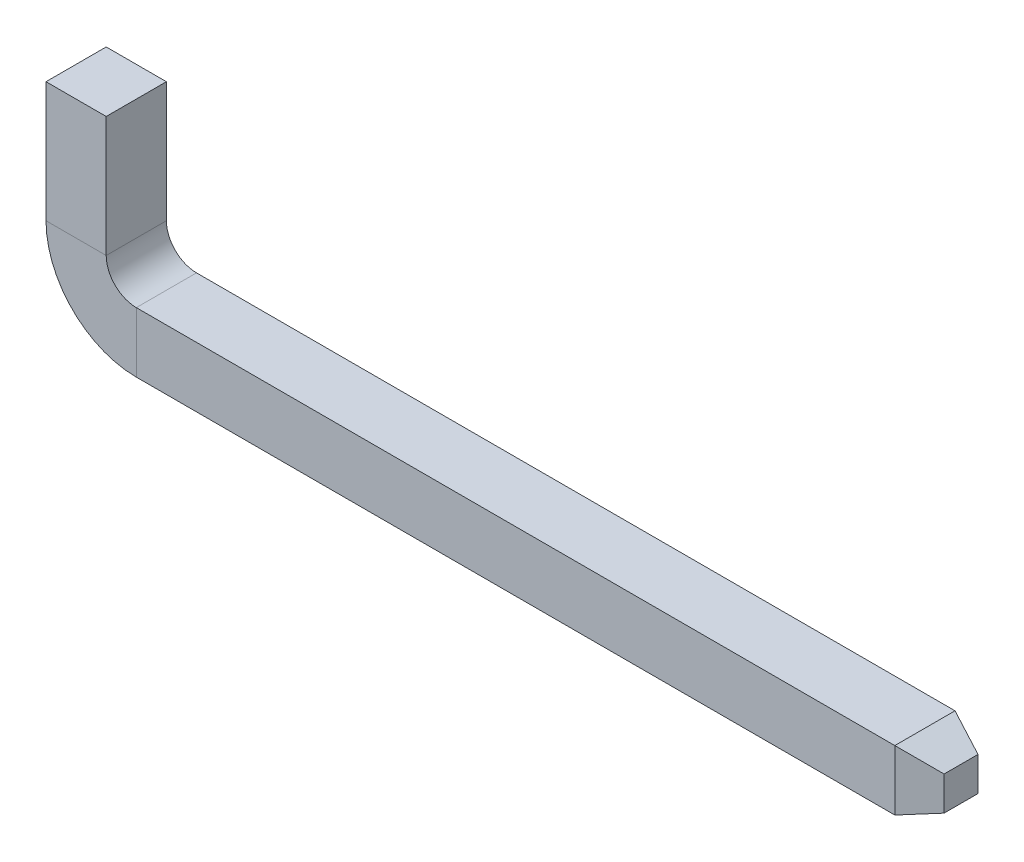
ISO-10303-21;
HEADER;
FILE_DESCRIPTION(('STEP AP214'),'2;1');
FILE_NAME('part.step','',(''),(''),'','','');
FILE_SCHEMA(('AUTOMOTIVE_DESIGN { 1 0 10303 214 1 1 1 1 }'));
ENDSEC;
DATA;
#1=APPLICATION_CONTEXT('core data for automotive mechanical design processes');
#2=APPLICATION_PROTOCOL_DEFINITION('international standard','automotive_design',2000,#1);
#3=PRODUCT_CONTEXT('',#1,'mechanical');
#4=PRODUCT('Part','Part','',(#3));
#5=PRODUCT_RELATED_PRODUCT_CATEGORY('part','',(#4));
#6=PRODUCT_DEFINITION_FORMATION('','',#4);
#7=PRODUCT_DEFINITION_CONTEXT('part definition',#1,'design');
#8=PRODUCT_DEFINITION('design','',#6,#7);
#9=PRODUCT_DEFINITION_SHAPE('','',#8);
#10=(LENGTH_UNIT() NAMED_UNIT(*) SI_UNIT(.MILLI.,.METRE.));
#11=(NAMED_UNIT(*) PLANE_ANGLE_UNIT() SI_UNIT($,.RADIAN.));
#12=(NAMED_UNIT(*) SI_UNIT($,.STERADIAN.) SOLID_ANGLE_UNIT());
#13=UNCERTAINTY_MEASURE_WITH_UNIT(LENGTH_MEASURE(1.E-05),#10,'distance_accuracy_value','');
#14=(GEOMETRIC_REPRESENTATION_CONTEXT(3) GLOBAL_UNCERTAINTY_ASSIGNED_CONTEXT((#13)) GLOBAL_UNIT_ASSIGNED_CONTEXT((#10,
#11,#12)) REPRESENTATION_CONTEXT('',''));
#15=CARTESIAN_POINT('',(0.,0.,0.));
#16=DIRECTION('',(0.,0.,1.));
#17=DIRECTION('',(1.,0.,0.));
#18=AXIS2_PLACEMENT_3D('',#15,#16,#17);
#19=CARTESIAN_POINT('',(0.,0.,0.));
#20=DIRECTION('',(0.,-1.,0.));
#21=DIRECTION('',(0.,0.,-1.));
#22=AXIS2_PLACEMENT_3D('',#19,#20,#21);
#23=PLANE('',#22);
#24=DIRECTION('',(0.,0.,-1.));
#25=VECTOR('',#24,1.);
#26=CARTESIAN_POINT('',(0.25,0.,0.25));
#27=LINE('',#26,#25);
#28=CARTESIAN_POINT('',(0.25,0.,0.25));
#29=VERTEX_POINT('',#28);
#30=CARTESIAN_POINT('',(0.25,0.,-0.25));
#31=VERTEX_POINT('',#30);
#32=EDGE_CURVE('E126',#29,#31,#27,.T.);
#33=ORIENTED_EDGE('',*,*,#32,.T.);
#34=DIRECTION('',(-1.,0.,0.));
#35=VECTOR('',#34,1.);
#36=CARTESIAN_POINT('',(-0.25,0.,-0.25));
#37=LINE('',#36,#35);
#38=CARTESIAN_POINT('',(-0.25,0.,-0.25));
#39=VERTEX_POINT('',#38);
#40=EDGE_CURVE('E154',#31,#39,#37,.T.);
#41=ORIENTED_EDGE('',*,*,#40,.T.);
#42=DIRECTION('',(0.,0.,1.));
#43=VECTOR('',#42,1.);
#44=CARTESIAN_POINT('',(-0.25,0.,0.25));
#45=LINE('',#44,#43);
#46=CARTESIAN_POINT('',(-0.25,0.,0.25));
#47=VERTEX_POINT('',#46);
#48=EDGE_CURVE('E157',#39,#47,#45,.T.);
#49=ORIENTED_EDGE('',*,*,#48,.T.);
#50=DIRECTION('',(1.,0.,0.));
#51=VECTOR('',#50,1.);
#52=CARTESIAN_POINT('',(-0.25,0.,0.25));
#53=LINE('',#52,#51);
#54=EDGE_CURVE('E174',#47,#29,#53,.T.);
#55=ORIENTED_EDGE('',*,*,#54,.T.);
#56=EDGE_LOOP('',(#33,#41,#49,#55));
#57=FACE_BOUND('',#56,.T.);
#58=ADVANCED_FACE('F35',(#57),#23,.F.);
#59=CARTESIAN_POINT('',(0.25,0.,0.25));
#60=DIRECTION('',(-1.,0.,0.));
#61=DIRECTION('',(0.,-1.,0.));
#62=AXIS2_PLACEMENT_3D('',#59,#60,#61);
#63=PLANE('',#62);
#64=DIRECTION('',(0.,-1.,0.));
#65=VECTOR('',#64,1.);
#66=CARTESIAN_POINT('',(0.25,0.,-0.25));
#67=LINE('',#66,#65);
#68=CARTESIAN_POINT('',(0.25,-1.,-0.25));
#69=VERTEX_POINT('',#68);
#70=EDGE_CURVE('E162',#31,#69,#67,.T.);
#71=ORIENTED_EDGE('',*,*,#70,.F.);
#72=ORIENTED_EDGE('',*,*,#32,.F.);
#73=DIRECTION('',(0.,-1.,0.));
#74=VECTOR('',#73,1.);
#75=CARTESIAN_POINT('',(0.25,0.,0.25));
#76=LINE('',#75,#74);
#77=CARTESIAN_POINT('',(0.25,-1.,0.25));
#78=VERTEX_POINT('',#77);
#79=EDGE_CURVE('E189',#29,#78,#76,.T.);
#80=ORIENTED_EDGE('',*,*,#79,.T.);
#81=DIRECTION('',(0.,0.,-1.));
#82=VECTOR('',#81,1.);
#83=CARTESIAN_POINT('',(0.25,-1.,0.25));
#84=LINE('',#83,#82);
#85=EDGE_CURVE('E205',#78,#69,#84,.T.);
#86=ORIENTED_EDGE('',*,*,#85,.T.);
#87=EDGE_LOOP('',(#71,#72,#80,#86));
#88=FACE_BOUND('',#87,.T.);
#89=ADVANCED_FACE('F274',(#88),#63,.F.);
#90=CARTESIAN_POINT('',(-0.25,0.,-0.25));
#91=DIRECTION('',(0.,0.,1.));
#92=DIRECTION('',(1.,0.,0.));
#93=AXIS2_PLACEMENT_3D('',#90,#91,#92);
#94=PLANE('',#93);
#95=DIRECTION('',(0.,-1.,0.));
#96=VECTOR('',#95,1.);
#97=CARTESIAN_POINT('',(-0.25,0.,-0.25));
#98=LINE('',#97,#96);
#99=CARTESIAN_POINT('',(-0.25,-1.,-0.25));
#100=VERTEX_POINT('',#99);
#101=EDGE_CURVE('E161',#39,#100,#98,.T.);
#102=ORIENTED_EDGE('',*,*,#101,.F.);
#103=ORIENTED_EDGE('',*,*,#40,.F.);
#104=ORIENTED_EDGE('',*,*,#70,.T.);
#105=DIRECTION('',(-1.,0.,0.));
#106=VECTOR('',#105,1.);
#107=CARTESIAN_POINT('',(-0.25,-1.,-0.25));
#108=LINE('',#107,#106);
#109=EDGE_CURVE('E158',#69,#100,#108,.T.);
#110=ORIENTED_EDGE('',*,*,#109,.T.);
#111=EDGE_LOOP('',(#102,#103,#104,#110));
#112=FACE_BOUND('',#111,.T.);
#113=ADVANCED_FACE('F266',(#112),#94,.F.);
#114=CARTESIAN_POINT('',(-0.25,0.,0.25));
#115=DIRECTION('',(1.,0.,0.));
#116=DIRECTION('',(0.,1.,0.));
#117=AXIS2_PLACEMENT_3D('',#114,#115,#116);
#118=PLANE('',#117);
#119=DIRECTION('',(0.,-1.,0.));
#120=VECTOR('',#119,1.);
#121=CARTESIAN_POINT('',(-0.25,0.,0.25));
#122=LINE('',#121,#120);
#123=CARTESIAN_POINT('',(-0.25,-1.,0.25));
#124=VERTEX_POINT('',#123);
#125=EDGE_CURVE('E177',#47,#124,#122,.T.);
#126=ORIENTED_EDGE('',*,*,#125,.F.);
#127=ORIENTED_EDGE('',*,*,#48,.F.);
#128=ORIENTED_EDGE('',*,*,#101,.T.);
#129=DIRECTION('',(0.,0.,1.));
#130=VECTOR('',#129,1.);
#131=CARTESIAN_POINT('',(-0.25,-1.,0.25));
#132=LINE('',#131,#130);
#133=EDGE_CURVE('E165',#100,#124,#132,.T.);
#134=ORIENTED_EDGE('',*,*,#133,.T.);
#135=EDGE_LOOP('',(#126,#127,#128,#134));
#136=FACE_BOUND('',#135,.T.);
#137=ADVANCED_FACE('F258',(#136),#118,.F.);
#138=CARTESIAN_POINT('',(-0.25,0.,0.25));
#139=DIRECTION('',(0.,0.,-1.));
#140=DIRECTION('',(-1.,0.,0.));
#141=AXIS2_PLACEMENT_3D('',#138,#139,#140);
#142=PLANE('',#141);
#143=DIRECTION('',(1.,0.,0.));
#144=VECTOR('',#143,1.);
#145=CARTESIAN_POINT('',(-0.25,-1.,0.25));
#146=LINE('',#145,#144);
#147=EDGE_CURVE('E180',#124,#78,#146,.T.);
#148=ORIENTED_EDGE('',*,*,#147,.T.);
#149=ORIENTED_EDGE('',*,*,#79,.F.);
#150=ORIENTED_EDGE('',*,*,#54,.F.);
#151=ORIENTED_EDGE('',*,*,#125,.T.);
#152=EDGE_LOOP('',(#148,#149,#150,#151));
#153=FACE_BOUND('',#152,.T.);
#154=ADVANCED_FACE('F256',(#153),#142,.F.);
#155=CARTESIAN_POINT('',(0.5,-1.,0.));
#156=DIRECTION('',(0.,0.,1.));
#157=DIRECTION('',(1.,0.,0.));
#158=AXIS2_PLACEMENT_3D('',#155,#156,#157);
#159=CYLINDRICAL_SURFACE('',#158,0.25);
#160=CARTESIAN_POINT('',(0.5,-1.,-0.25));
#161=DIRECTION('',(0.,0.,1.));
#162=DIRECTION('',(-1.,0.,0.));
#163=AXIS2_PLACEMENT_3D('',#160,#161,#162);
#164=CIRCLE('',#163,0.25);
#165=CARTESIAN_POINT('',(0.5,-1.25,-0.25));
#166=VERTEX_POINT('',#165);
#167=EDGE_CURVE('E167',#69,#166,#164,.T.);
#168=ORIENTED_EDGE('',*,*,#167,.F.);
#169=ORIENTED_EDGE('',*,*,#85,.F.);
#170=CARTESIAN_POINT('',(0.5,-1.,0.25));
#171=DIRECTION('',(0.,0.,1.));
#172=DIRECTION('',(-1.,0.,0.));
#173=AXIS2_PLACEMENT_3D('',#170,#171,#172);
#174=CIRCLE('',#173,0.25);
#175=CARTESIAN_POINT('',(0.5,-1.25,0.25));
#176=VERTEX_POINT('',#175);
#177=EDGE_CURVE('E191',#78,#176,#174,.T.);
#178=ORIENTED_EDGE('',*,*,#177,.T.);
#179=DIRECTION('',(0.,0.,-1.));
#180=VECTOR('',#179,1.);
#181=CARTESIAN_POINT('',(0.5,-1.25,0.25));
#182=LINE('',#181,#180);
#183=EDGE_CURVE('E199',#176,#166,#182,.T.);
#184=ORIENTED_EDGE('',*,*,#183,.T.);
#185=EDGE_LOOP('',(#168,#169,#178,#184));
#186=FACE_BOUND('',#185,.T.);
#187=ADVANCED_FACE('F203',(#186),#159,.F.);
#188=CARTESIAN_POINT('',(-0.25,-1.,-0.25));
#189=DIRECTION('',(0.,0.,1.));
#190=DIRECTION('',(1.,0.,0.));
#191=AXIS2_PLACEMENT_3D('',#188,#189,#190);
#192=PLANE('',#191);
#193=CARTESIAN_POINT('',(0.5,-1.,-0.25));
#194=DIRECTION('',(0.,0.,1.));
#195=DIRECTION('',(-1.,0.,0.));
#196=AXIS2_PLACEMENT_3D('',#193,#194,#195);
#197=CIRCLE('',#196,0.75);
#198=CARTESIAN_POINT('',(0.5,-1.75,-0.25));
#199=VERTEX_POINT('',#198);
#200=EDGE_CURVE('E80',#100,#199,#197,.T.);
#201=ORIENTED_EDGE('',*,*,#200,.F.);
#202=ORIENTED_EDGE('',*,*,#109,.F.);
#203=ORIENTED_EDGE('',*,*,#167,.T.);
#204=DIRECTION('',(0.,-1.,0.));
#205=VECTOR('',#204,1.);
#206=CARTESIAN_POINT('',(0.5,-1.75,-0.25));
#207=LINE('',#206,#205);
#208=EDGE_CURVE('E147',#166,#199,#207,.T.);
#209=ORIENTED_EDGE('',*,*,#208,.T.);
#210=EDGE_LOOP('',(#201,#202,#203,#209));
#211=FACE_BOUND('',#210,.T.);
#212=ADVANCED_FACE('F263',(#211),#192,.F.);
#213=CARTESIAN_POINT('',(0.5,-1.,0.));
#214=DIRECTION('',(0.,0.,1.));
#215=DIRECTION('',(1.,0.,0.));
#216=AXIS2_PLACEMENT_3D('',#213,#214,#215);
#217=CYLINDRICAL_SURFACE('',#216,0.75);
#218=CARTESIAN_POINT('',(0.5,-1.,0.25));
#219=DIRECTION('',(0.,0.,1.));
#220=DIRECTION('',(-1.,0.,0.));
#221=AXIS2_PLACEMENT_3D('',#218,#219,#220);
#222=CIRCLE('',#221,0.75);
#223=CARTESIAN_POINT('',(0.5,-1.75,0.25));
#224=VERTEX_POINT('',#223);
#225=EDGE_CURVE('E69',#124,#224,#222,.T.);
#226=ORIENTED_EDGE('',*,*,#225,.F.);
#227=ORIENTED_EDGE('',*,*,#133,.F.);
#228=ORIENTED_EDGE('',*,*,#200,.T.);
#229=DIRECTION('',(0.,0.,1.));
#230=VECTOR('',#229,1.);
#231=CARTESIAN_POINT('',(0.5,-1.75,0.25));
#232=LINE('',#231,#230);
#233=EDGE_CURVE('E168',#199,#224,#232,.T.);
#234=ORIENTED_EDGE('',*,*,#233,.T.);
#235=EDGE_LOOP('',(#226,#227,#228,#234));
#236=FACE_BOUND('',#235,.T.);
#237=ADVANCED_FACE('F255',(#236),#217,.T.);
#238=CARTESIAN_POINT('',(-0.25,-1.,0.25));
#239=DIRECTION('',(0.,0.,-1.));
#240=DIRECTION('',(-1.,0.,0.));
#241=AXIS2_PLACEMENT_3D('',#238,#239,#240);
#242=PLANE('',#241);
#243=DIRECTION('',(0.,1.,0.));
#244=VECTOR('',#243,1.);
#245=CARTESIAN_POINT('',(0.5,-1.75,0.25));
#246=LINE('',#245,#244);
#247=EDGE_CURVE('E153',#224,#176,#246,.T.);
#248=ORIENTED_EDGE('',*,*,#247,.T.);
#249=ORIENTED_EDGE('',*,*,#177,.F.);
#250=ORIENTED_EDGE('',*,*,#147,.F.);
#251=ORIENTED_EDGE('',*,*,#225,.T.);
#252=EDGE_LOOP('',(#248,#249,#250,#251));
#253=FACE_BOUND('',#252,.T.);
#254=ADVANCED_FACE('F195',(#253),#242,.F.);
#255=CARTESIAN_POINT('',(0.5,-1.25,0.25));
#256=DIRECTION('',(0.,-1.,0.));
#257=DIRECTION('',(0.,0.,-1.));
#258=AXIS2_PLACEMENT_3D('',#255,#256,#257);
#259=PLANE('',#258);
#260=DIRECTION('',(1.,0.,0.));
#261=VECTOR('',#260,1.);
#262=CARTESIAN_POINT('',(0.5,-1.25,-0.25));
#263=LINE('',#262,#261);
#264=CARTESIAN_POINT('',(6.8,-1.25,-0.25));
#265=VERTEX_POINT('',#264);
#266=EDGE_CURVE('E137',#166,#265,#263,.T.);
#267=ORIENTED_EDGE('',*,*,#266,.F.);
#268=ORIENTED_EDGE('',*,*,#183,.F.);
#269=DIRECTION('',(1.,0.,0.));
#270=VECTOR('',#269,1.);
#271=CARTESIAN_POINT('',(0.5,-1.25,0.25));
#272=LINE('',#271,#270);
#273=CARTESIAN_POINT('',(6.8,-1.25,0.25));
#274=VERTEX_POINT('',#273);
#275=EDGE_CURVE('E144',#176,#274,#272,.T.);
#276=ORIENTED_EDGE('',*,*,#275,.T.);
#277=DIRECTION('',(0.,0.,-1.));
#278=VECTOR('',#277,1.);
#279=CARTESIAN_POINT('',(6.8,-1.25,0.25));
#280=LINE('',#279,#278);
#281=EDGE_CURVE('E122',#274,#265,#280,.T.);
#282=ORIENTED_EDGE('',*,*,#281,.T.);
#283=EDGE_LOOP('',(#267,#268,#276,#282));
#284=FACE_BOUND('',#283,.T.);
#285=ADVANCED_FACE('F141',(#284),#259,.F.);
#286=CARTESIAN_POINT('',(0.5,-1.75,-0.25));
#287=DIRECTION('',(0.,0.,1.));
#288=DIRECTION('',(1.,0.,0.));
#289=AXIS2_PLACEMENT_3D('',#286,#287,#288);
#290=PLANE('',#289);
#291=DIRECTION('',(1.,0.,0.));
#292=VECTOR('',#291,1.);
#293=CARTESIAN_POINT('',(0.5,-1.75,-0.25));
#294=LINE('',#293,#292);
#295=CARTESIAN_POINT('',(6.8,-1.75,-0.25));
#296=VERTEX_POINT('',#295);
#297=EDGE_CURVE('E136',#199,#296,#294,.T.);
#298=ORIENTED_EDGE('',*,*,#297,.F.);
#299=ORIENTED_EDGE('',*,*,#208,.F.);
#300=ORIENTED_EDGE('',*,*,#266,.T.);
#301=DIRECTION('',(0.,-1.,0.));
#302=VECTOR('',#301,1.);
#303=CARTESIAN_POINT('',(6.8,-1.75,-0.25));
#304=LINE('',#303,#302);
#305=EDGE_CURVE('E130',#265,#296,#304,.T.);
#306=ORIENTED_EDGE('',*,*,#305,.T.);
#307=EDGE_LOOP('',(#298,#299,#300,#306));
#308=FACE_BOUND('',#307,.T.);
#309=ADVANCED_FACE('F146',(#308),#290,.F.);
#310=CARTESIAN_POINT('',(0.5,-1.75,0.25));
#311=DIRECTION('',(0.,1.,0.));
#312=DIRECTION('',(0.,0.,1.));
#313=AXIS2_PLACEMENT_3D('',#310,#311,#312);
#314=PLANE('',#313);
#315=DIRECTION('',(1.,0.,0.));
#316=VECTOR('',#315,1.);
#317=CARTESIAN_POINT('',(0.5,-1.75,0.25));
#318=LINE('',#317,#316);
#319=CARTESIAN_POINT('',(6.8,-1.75,0.25));
#320=VERTEX_POINT('',#319);
#321=EDGE_CURVE('E43',#224,#320,#318,.T.);
#322=ORIENTED_EDGE('',*,*,#321,.F.);
#323=ORIENTED_EDGE('',*,*,#233,.F.);
#324=ORIENTED_EDGE('',*,*,#297,.T.);
#325=DIRECTION('',(0.,0.,1.));
#326=VECTOR('',#325,1.);
#327=CARTESIAN_POINT('',(6.8,-1.75,0.25));
#328=LINE('',#327,#326);
#329=EDGE_CURVE('E171',#296,#320,#328,.T.);
#330=ORIENTED_EDGE('',*,*,#329,.T.);
#331=EDGE_LOOP('',(#322,#323,#324,#330));
#332=FACE_BOUND('',#331,.T.);
#333=ADVANCED_FACE('F233',(#332),#314,.F.);
#334=CARTESIAN_POINT('',(0.5,-1.75,0.25));
#335=DIRECTION('',(0.,0.,-1.));
#336=DIRECTION('',(-1.,0.,0.));
#337=AXIS2_PLACEMENT_3D('',#334,#335,#336);
#338=PLANE('',#337);
#339=DIRECTION('',(0.,1.,0.));
#340=VECTOR('',#339,1.);
#341=CARTESIAN_POINT('',(6.8,-1.75,0.25));
#342=LINE('',#341,#340);
#343=EDGE_CURVE('E11',#320,#274,#342,.T.);
#344=ORIENTED_EDGE('',*,*,#343,.T.);
#345=ORIENTED_EDGE('',*,*,#275,.F.);
#346=ORIENTED_EDGE('',*,*,#247,.F.);
#347=ORIENTED_EDGE('',*,*,#321,.T.);
#348=EDGE_LOOP('',(#344,#345,#346,#347));
#349=FACE_BOUND('',#348,.T.);
#350=ADVANCED_FACE('F235',(#349),#338,.F.);
#351=CARTESIAN_POINT('',(6.8,-1.75,-0.25));
#352=DIRECTION('',(0.342020143325669,0.,-0.939692620785908));
#353=DIRECTION('',(-0.939692620785908,0.,-0.342020143325669));
#354=AXIS2_PLACEMENT_3D('',#351,#352,#353);
#355=PLANE('',#354);
#356=ORIENTED_EDGE('',*,*,#305,.F.);
#357=DIRECTION('',(-0.889126490715988,0.323615577118185,-0.323615577118185));
#358=VECTOR('',#357,1.);
#359=CARTESIAN_POINT('',(6.8,-1.25,-0.25));
#360=LINE('',#359,#358);
#361=CARTESIAN_POINT('',(7.1,-1.35919107027986,-0.140808929720139));
#362=VERTEX_POINT('',#361);
#363=EDGE_CURVE('E118',#362,#265,#360,.T.);
#364=ORIENTED_EDGE('',*,*,#363,.F.);
#365=DIRECTION('',(0.,-1.,0.));
#366=VECTOR('',#365,1.);
#367=CARTESIAN_POINT('',(7.1,-1.75,-0.140808929720139));
#368=LINE('',#367,#366);
#369=CARTESIAN_POINT('',(7.1,-1.64080892972014,-0.140808929720139));
#370=VERTEX_POINT('',#369);
#371=EDGE_CURVE('E220',#370,#362,#368,.F.);
#372=ORIENTED_EDGE('',*,*,#371,.F.);
#373=DIRECTION('',(-0.889126490715988,-0.323615577118185,-0.323615577118185));
#374=VECTOR('',#373,1.);
#375=CARTESIAN_POINT('',(6.8,-1.75,-0.25));
#376=LINE('',#375,#374);
#377=EDGE_CURVE('E50',#370,#296,#376,.T.);
#378=ORIENTED_EDGE('',*,*,#377,.T.);
#379=EDGE_LOOP('',(#356,#364,#372,#378));
#380=FACE_BOUND('',#379,.T.);
#381=ADVANCED_FACE('F131',(#380),#355,.T.);
#382=CARTESIAN_POINT('',(6.8,-1.25,-0.25));
#383=DIRECTION('',(0.342020143325669,0.939692620785908,0.));
#384=DIRECTION('',(-0.939692620785908,0.342020143325669,0.));
#385=AXIS2_PLACEMENT_3D('',#382,#383,#384);
#386=PLANE('',#385);
#387=ORIENTED_EDGE('',*,*,#281,.F.);
#388=DIRECTION('',(-0.889126490715988,0.323615577118185,0.323615577118185));
#389=VECTOR('',#388,1.);
#390=CARTESIAN_POINT('',(6.8,-1.25,0.25));
#391=LINE('',#390,#389);
#392=CARTESIAN_POINT('',(7.1,-1.35919107027986,0.140808929720139));
#393=VERTEX_POINT('',#392);
#394=EDGE_CURVE('E127',#393,#274,#391,.T.);
#395=ORIENTED_EDGE('',*,*,#394,.F.);
#396=DIRECTION('',(0.,0.,-1.));
#397=VECTOR('',#396,1.);
#398=CARTESIAN_POINT('',(7.1,-1.35919107027986,-0.25));
#399=LINE('',#398,#397);
#400=EDGE_CURVE('E124',#362,#393,#399,.F.);
#401=ORIENTED_EDGE('',*,*,#400,.F.);
#402=ORIENTED_EDGE('',*,*,#363,.T.);
#403=EDGE_LOOP('',(#387,#395,#401,#402));
#404=FACE_BOUND('',#403,.T.);
#405=ADVANCED_FACE('F119',(#404),#386,.T.);
#406=CARTESIAN_POINT('',(6.8,-1.25,0.25));
#407=DIRECTION('',(0.342020143325669,0.,0.939692620785908));
#408=DIRECTION('',(0.939692620785908,0.,-0.342020143325669));
#409=AXIS2_PLACEMENT_3D('',#406,#407,#408);
#410=PLANE('',#409);
#411=ORIENTED_EDGE('',*,*,#343,.F.);
#412=DIRECTION('',(-0.889126490715988,-0.323615577118185,0.323615577118185));
#413=VECTOR('',#412,1.);
#414=CARTESIAN_POINT('',(6.8,-1.75,0.25));
#415=LINE('',#414,#413);
#416=CARTESIAN_POINT('',(7.1,-1.64080892972014,0.140808929720139));
#417=VERTEX_POINT('',#416);
#418=EDGE_CURVE('E223',#417,#320,#415,.T.);
#419=ORIENTED_EDGE('',*,*,#418,.F.);
#420=DIRECTION('',(0.,1.,0.));
#421=VECTOR('',#420,1.);
#422=CARTESIAN_POINT('',(7.1,-1.25,0.140808929720139));
#423=LINE('',#422,#421);
#424=EDGE_CURVE('E217',#393,#417,#423,.F.);
#425=ORIENTED_EDGE('',*,*,#424,.F.);
#426=ORIENTED_EDGE('',*,*,#394,.T.);
#427=EDGE_LOOP('',(#411,#419,#425,#426));
#428=FACE_BOUND('',#427,.T.);
#429=ADVANCED_FACE('F236',(#428),#410,.T.);
#430=CARTESIAN_POINT('',(6.8,-1.75,0.25));
#431=DIRECTION('',(0.342020143325669,-0.939692620785908,0.));
#432=DIRECTION('',(0.939692620785908,0.342020143325669,0.));
#433=AXIS2_PLACEMENT_3D('',#430,#431,#432);
#434=PLANE('',#433);
#435=ORIENTED_EDGE('',*,*,#329,.F.);
#436=ORIENTED_EDGE('',*,*,#377,.F.);
#437=DIRECTION('',(0.,0.,1.));
#438=VECTOR('',#437,1.);
#439=CARTESIAN_POINT('',(7.1,-1.64080892972014,0.25));
#440=LINE('',#439,#438);
#441=EDGE_CURVE('E215',#417,#370,#440,.F.);
#442=ORIENTED_EDGE('',*,*,#441,.F.);
#443=ORIENTED_EDGE('',*,*,#418,.T.);
#444=EDGE_LOOP('',(#435,#436,#442,#443));
#445=FACE_BOUND('',#444,.T.);
#446=ADVANCED_FACE('F229',(#445),#434,.T.);
#447=CARTESIAN_POINT('',(7.1,0.,0.));
#448=DIRECTION('',(1.,0.,0.));
#449=DIRECTION('',(0.,0.,-1.));
#450=AXIS2_PLACEMENT_3D('',#447,#448,#449);
#451=PLANE('',#450);
#452=ORIENTED_EDGE('',*,*,#371,.T.);
#453=ORIENTED_EDGE('',*,*,#400,.T.);
#454=ORIENTED_EDGE('',*,*,#424,.T.);
#455=ORIENTED_EDGE('',*,*,#441,.T.);
#456=EDGE_LOOP('',(#452,#453,#454,#455));
#457=FACE_BOUND('',#456,.T.);
#458=ADVANCED_FACE('F238',(#457),#451,.T.);
#459=CLOSED_SHELL('',(#58,#89,#113,#137,#154,#187,#212,#237,#254,#285,#309,#333,#350,#381,#405,
#429,#446,#458));
#460=MANIFOLD_SOLID_BREP('B2',#459);
#461=ADVANCED_BREP_SHAPE_REPRESENTATION('',(#18,#460),#14);
#462=SHAPE_DEFINITION_REPRESENTATION(#9,#461);
ENDSEC;
END-ISO-10303-21;
